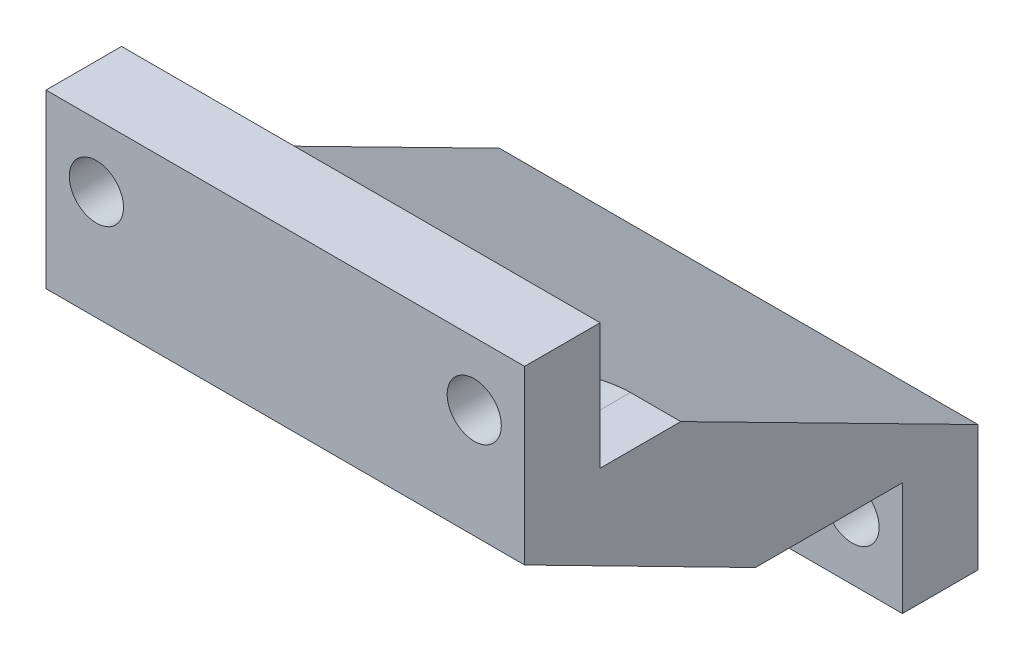
ISO-10303-21;
HEADER;
FILE_DESCRIPTION(('STEP AP214'),'2;1');
FILE_NAME('part.step','',(''),(''),'','','');
FILE_SCHEMA(('AUTOMOTIVE_DESIGN { 1 0 10303 214 1 1 1 1 }'));
ENDSEC;
DATA;
#1=APPLICATION_CONTEXT('core data for automotive mechanical design processes');
#2=APPLICATION_PROTOCOL_DEFINITION('international standard','automotive_design',2000,#1);
#3=PRODUCT_CONTEXT('',#1,'mechanical');
#4=PRODUCT('Part','Part','',(#3));
#5=PRODUCT_RELATED_PRODUCT_CATEGORY('part','',(#4));
#6=PRODUCT_DEFINITION_FORMATION('','',#4);
#7=PRODUCT_DEFINITION_CONTEXT('part definition',#1,'design');
#8=PRODUCT_DEFINITION('design','',#6,#7);
#9=PRODUCT_DEFINITION_SHAPE('','',#8);
#10=(LENGTH_UNIT() NAMED_UNIT(*) SI_UNIT(.MILLI.,.METRE.));
#11=(NAMED_UNIT(*) PLANE_ANGLE_UNIT() SI_UNIT($,.RADIAN.));
#12=(NAMED_UNIT(*) SI_UNIT($,.STERADIAN.) SOLID_ANGLE_UNIT());
#13=UNCERTAINTY_MEASURE_WITH_UNIT(LENGTH_MEASURE(1.E-05),#10,'distance_accuracy_value','');
#14=(GEOMETRIC_REPRESENTATION_CONTEXT(3) GLOBAL_UNCERTAINTY_ASSIGNED_CONTEXT((#13)) GLOBAL_UNIT_ASSIGNED_CONTEXT((#10,
#11,#12)) REPRESENTATION_CONTEXT('',''));
#15=CARTESIAN_POINT('',(0.,0.,0.));
#16=DIRECTION('',(0.,0.,1.));
#17=DIRECTION('',(1.,0.,0.));
#18=AXIS2_PLACEMENT_3D('',#15,#16,#17);
#19=CARTESIAN_POINT('',(84.988658439,-74.005114056,-33.2));
#20=DIRECTION('',(0.,0.,-1.));
#21=DIRECTION('',(0.,-1.,0.));
#22=AXIS2_PLACEMENT_3D('',#19,#20,#21);
#23=CYLINDRICAL_SURFACE('',#22,5.);
#24=DIRECTION('',(0.,0.,-1.));
#25=VECTOR('',#24,1.);
#26=CARTESIAN_POINT('',(84.988658439,-79.005114056,-33.2));
#27=LINE('',#26,#25);
#28=CARTESIAN_POINT('',(84.988658439,-79.005114056,-33.2));
#29=VERTEX_POINT('',#28);
#30=CARTESIAN_POINT('',(84.988658439,-79.005114056,-39.603895088));
#31=VERTEX_POINT('',#30);
#32=EDGE_CURVE('E11',#29,#31,#27,.T.);
#33=ORIENTED_EDGE('',*,*,#32,.F.);
#34=CARTESIAN_POINT('',(84.988658439,-74.005114056,-33.2));
#35=DIRECTION('',(0.,0.,1.));
#36=DIRECTION('',(1.,0.,0.));
#37=AXIS2_PLACEMENT_3D('',#34,#35,#36);
#38=CIRCLE('',#37,5.);
#39=CARTESIAN_POINT('',(89.674925408,-75.7483587,-33.2));
#40=VERTEX_POINT('',#39);
#41=EDGE_CURVE('E347',#29,#40,#38,.T.);
#42=ORIENTED_EDGE('',*,*,#41,.T.);
#43=CARTESIAN_POINT('',(84.988658439,-74.005114056,-29.772184708));
#44=DIRECTION('',(0.,-0.891354901098317,0.45330612205));
#45=DIRECTION('',(0.,-0.45330612205,-0.891354901098317));
#46=AXIS2_PLACEMENT_3D('',#43,#44,#45);
#47=ELLIPSE('',#46,11.030073844,5.);
#48=EDGE_CURVE('E323',#31,#40,#47,.T.);
#49=ORIENTED_EDGE('',*,*,#48,.F.);
#50=EDGE_LOOP('',(#33,#42,#49));
#51=FACE_BOUND('',#50,.T.);
#52=ADVANCED_FACE('F16',(#51),#23,.F.);
#53=CARTESIAN_POINT('',(84.988658439,-79.005114056,-33.2));
#54=DIRECTION('',(0.,1.,0.));
#55=DIRECTION('',(1.,0.,0.));
#56=AXIS2_PLACEMENT_3D('',#53,#54,#55);
#57=PLANE('',#56);
#58=DIRECTION('',(0.,0.,-1.));
#59=VECTOR('',#58,1.);
#60=CARTESIAN_POINT('',(80.988658439,-79.005114056,-33.2));
#61=LINE('',#60,#59);
#62=CARTESIAN_POINT('',(80.988658439,-79.005114056,-33.2));
#63=VERTEX_POINT('',#62);
#64=CARTESIAN_POINT('',(80.988658439,-79.005114056,-39.603895088));
#65=VERTEX_POINT('',#64);
#66=EDGE_CURVE('E457',#63,#65,#61,.T.);
#67=ORIENTED_EDGE('',*,*,#66,.F.);
#68=DIRECTION('',(1.,0.,0.));
#69=VECTOR('',#68,1.);
#70=CARTESIAN_POINT('',(80.988658439,-79.005114056,-33.2));
#71=LINE('',#70,#69);
#72=EDGE_CURVE('E444',#63,#29,#71,.T.);
#73=ORIENTED_EDGE('',*,*,#72,.T.);
#74=ORIENTED_EDGE('',*,*,#32,.T.);
#75=DIRECTION('',(1.,0.,0.));
#76=VECTOR('',#75,1.);
#77=CARTESIAN_POINT('',(80.988658439,-79.005114056,-39.603895088));
#78=LINE('',#77,#76);
#79=EDGE_CURVE('E328',#65,#31,#78,.T.);
#80=ORIENTED_EDGE('',*,*,#79,.F.);
#81=EDGE_LOOP('',(#67,#73,#74,#80));
#82=FACE_BOUND('',#81,.T.);
#83=ADVANCED_FACE('F525',(#82),#57,.T.);
#84=CARTESIAN_POINT('',(114.988658439,-79.005114056,-33.2));
#85=DIRECTION('',(0.,1.,0.));
#86=DIRECTION('',(1.,0.,0.));
#87=AXIS2_PLACEMENT_3D('',#84,#85,#86);
#88=PLANE('',#87);
#89=DIRECTION('',(0.,0.,-1.));
#90=VECTOR('',#89,1.);
#91=CARTESIAN_POINT('',(114.988658439,-79.005114056,-33.2));
#92=LINE('',#91,#90);
#93=CARTESIAN_POINT('',(114.988658439,-79.005114056,-33.2));
#94=VERTEX_POINT('',#93);
#95=CARTESIAN_POINT('',(114.988658439,-79.005114056,-39.603895088));
#96=VERTEX_POINT('',#95);
#97=EDGE_CURVE('E27',#94,#96,#92,.T.);
#98=ORIENTED_EDGE('',*,*,#97,.F.);
#99=DIRECTION('',(1.,0.,0.));
#100=VECTOR('',#99,1.);
#101=CARTESIAN_POINT('',(114.988658439,-79.005114056,-33.2));
#102=LINE('',#101,#100);
#103=CARTESIAN_POINT('',(118.988658439,-79.005114056,-33.2));
#104=VERTEX_POINT('',#103);
#105=EDGE_CURVE('E318',#94,#104,#102,.T.);
#106=ORIENTED_EDGE('',*,*,#105,.T.);
#107=DIRECTION('',(0.,0.,-1.));
#108=VECTOR('',#107,1.);
#109=CARTESIAN_POINT('',(118.988658439,-79.005114056,-33.2));
#110=LINE('',#109,#108);
#111=CARTESIAN_POINT('',(118.988658439,-79.005114056,-39.603895088));
#112=VERTEX_POINT('',#111);
#113=EDGE_CURVE('E299',#104,#112,#110,.T.);
#114=ORIENTED_EDGE('',*,*,#113,.T.);
#115=DIRECTION('',(1.,0.,0.));
#116=VECTOR('',#115,1.);
#117=CARTESIAN_POINT('',(114.988658439,-79.005114056,-39.603895088));
#118=LINE('',#117,#116);
#119=EDGE_CURVE('E304',#96,#112,#118,.T.);
#120=ORIENTED_EDGE('',*,*,#119,.F.);
#121=EDGE_LOOP('',(#98,#106,#114,#120));
#122=FACE_BOUND('',#121,.T.);
#123=ADVANCED_FACE('F531',(#122),#88,.T.);
#124=CARTESIAN_POINT('',(114.988658439,-74.005114056,-33.2));
#125=DIRECTION('',(0.,0.,-1.));
#126=DIRECTION('',(-1.,0.,0.));
#127=AXIS2_PLACEMENT_3D('',#124,#125,#126);
#128=CYLINDRICAL_SURFACE('',#127,5.);
#129=CARTESIAN_POINT('',(114.988658439,-74.005114056,-33.2));
#130=DIRECTION('',(0.,0.,1.));
#131=DIRECTION('',(1.,0.,0.));
#132=AXIS2_PLACEMENT_3D('',#129,#130,#131);
#133=CIRCLE('',#132,5.);
#134=CARTESIAN_POINT('',(110.302391469,-75.7483587,-33.2));
#135=VERTEX_POINT('',#134);
#136=EDGE_CURVE('E313',#135,#94,#133,.T.);
#137=ORIENTED_EDGE('',*,*,#136,.T.);
#138=ORIENTED_EDGE('',*,*,#97,.T.);
#139=CARTESIAN_POINT('',(114.988658439,-74.005114056,-29.772184708));
#140=DIRECTION('',(0.,-0.891354901098317,0.45330612205));
#141=DIRECTION('',(0.,-0.45330612205,-0.891354901098317));
#142=AXIS2_PLACEMENT_3D('',#139,#140,#141);
#143=ELLIPSE('',#142,11.030073844,5.);
#144=EDGE_CURVE('E416',#135,#96,#143,.T.);
#145=ORIENTED_EDGE('',*,*,#144,.F.);
#146=EDGE_LOOP('',(#137,#138,#145));
#147=FACE_BOUND('',#146,.T.);
#148=ADVANCED_FACE('F543',(#147),#128,.F.);
#149=CARTESIAN_POINT('',(110.988658439,-96.005114056,-24.2));
#150=DIRECTION('',(1.,0.,0.));
#151=DIRECTION('',(0.,1.,0.));
#152=AXIS2_PLACEMENT_3D('',#149,#150,#151);
#153=PLANE('',#152);
#154=DIRECTION('',(0.,-1.,0.));
#155=VECTOR('',#154,1.);
#156=CARTESIAN_POINT('',(110.988658439,-96.005114056,-57.2));
#157=LINE('',#156,#155);
#158=CARTESIAN_POINT('',(110.988658439,-96.005114056,-57.2));
#159=VERTEX_POINT('',#158);
#160=CARTESIAN_POINT('',(110.988658439,-97.94844739,-57.2));
#161=VERTEX_POINT('',#160);
#162=EDGE_CURVE('E393',#159,#161,#157,.T.);
#163=ORIENTED_EDGE('',*,*,#162,.F.);
#164=DIRECTION('',(0.,0.,-1.));
#165=VECTOR('',#164,1.);
#166=CARTESIAN_POINT('',(110.988658439,-96.005114056,-53.385387132));
#167=LINE('',#166,#165);
#168=CARTESIAN_POINT('',(110.988658439,-96.005114056,-53.385387132));
#169=VERTEX_POINT('',#168);
#170=EDGE_CURVE('E356',#169,#159,#167,.T.);
#171=ORIENTED_EDGE('',*,*,#170,.F.);
#172=DIRECTION('',(0.,0.453933197028941,0.891035719056809));
#173=VECTOR('',#172,1.);
#174=CARTESIAN_POINT('',(110.988658439,-97.94844739,-57.2));
#175=LINE('',#174,#173);
#176=EDGE_CURVE('E309',#161,#169,#175,.T.);
#177=ORIENTED_EDGE('',*,*,#176,.F.);
#178=EDGE_LOOP('',(#163,#171,#177));
#179=FACE_BOUND('',#178,.T.);
#180=ADVANCED_FACE('F546',(#179),#153,.T.);
#181=CARTESIAN_POINT('',(114.988658439,-96.005114056,-24.2));
#182=DIRECTION('',(0.,0.,-1.));
#183=DIRECTION('',(0.,1.,0.));
#184=AXIS2_PLACEMENT_3D('',#181,#182,#183);
#185=CYLINDRICAL_SURFACE('',#184,4.);
#186=ORIENTED_EDGE('',*,*,#170,.T.);
#187=CARTESIAN_POINT('',(114.988658439,-96.005114056,-57.2));
#188=DIRECTION('',(0.,0.,1.));
#189=DIRECTION('',(0.,-1.,0.));
#190=AXIS2_PLACEMENT_3D('',#187,#188,#189);
#191=CIRCLE('',#190,4.);
#192=CARTESIAN_POINT('',(114.988658439,-92.005114056,-57.2));
#193=VERTEX_POINT('',#192);
#194=EDGE_CURVE('E482',#193,#159,#191,.T.);
#195=ORIENTED_EDGE('',*,*,#194,.F.);
#196=DIRECTION('',(0.,0.,-1.));
#197=VECTOR('',#196,1.);
#198=CARTESIAN_POINT('',(114.988658439,-92.005114056,-45.533696838));
#199=LINE('',#198,#197);
#200=CARTESIAN_POINT('',(114.988658439,-92.005114056,-45.533696838));
#201=VERTEX_POINT('',#200);
#202=EDGE_CURVE('E359',#201,#193,#199,.T.);
#203=ORIENTED_EDGE('',*,*,#202,.F.);
#204=CARTESIAN_POINT('',(114.988658439,-96.005114056,-53.385387132));
#205=DIRECTION('',(0.,0.891035719056809,-0.453933197028941));
#206=DIRECTION('',(0.,-0.453933197028941,-0.891035719056809));
#207=AXIS2_PLACEMENT_3D('',#204,#205,#206);
#208=ELLIPSE('',#207,8.811869295,4.);
#209=EDGE_CURVE('E288',#169,#201,#208,.T.);
#210=ORIENTED_EDGE('',*,*,#209,.F.);
#211=EDGE_LOOP('',(#186,#195,#203,#210));
#212=FACE_BOUND('',#211,.T.);
#213=ADVANCED_FACE('F552',(#212),#185,.F.);
#214=CARTESIAN_POINT('',(114.988658439,-92.005114056,-24.2));
#215=DIRECTION('',(0.,-1.,0.));
#216=DIRECTION('',(0.,0.,-1.));
#217=AXIS2_PLACEMENT_3D('',#214,#215,#216);
#218=PLANE('',#217);
#219=ORIENTED_EDGE('',*,*,#202,.T.);
#220=DIRECTION('',(-1.,0.,0.));
#221=VECTOR('',#220,1.);
#222=CARTESIAN_POINT('',(118.988658439,-92.005114056,-57.2));
#223=LINE('',#222,#221);
#224=CARTESIAN_POINT('',(118.988658439,-92.005114056,-57.2));
#225=VERTEX_POINT('',#224);
#226=EDGE_CURVE('E20',#225,#193,#223,.T.);
#227=ORIENTED_EDGE('',*,*,#226,.F.);
#228=DIRECTION('',(0.,0.,-1.));
#229=VECTOR('',#228,1.);
#230=CARTESIAN_POINT('',(118.988658439,-92.005114056,-45.533696838));
#231=LINE('',#230,#229);
#232=CARTESIAN_POINT('',(118.988658439,-92.005114056,-45.533696838));
#233=VERTEX_POINT('',#232);
#234=EDGE_CURVE('E264',#233,#225,#231,.T.);
#235=ORIENTED_EDGE('',*,*,#234,.F.);
#236=DIRECTION('',(1.,0.,0.));
#237=VECTOR('',#236,1.);
#238=CARTESIAN_POINT('',(114.988658439,-92.005114056,-45.533696838));
#239=LINE('',#238,#237);
#240=EDGE_CURVE('E281',#201,#233,#239,.T.);
#241=ORIENTED_EDGE('',*,*,#240,.F.);
#242=EDGE_LOOP('',(#219,#227,#235,#241));
#243=FACE_BOUND('',#242,.T.);
#244=ADVANCED_FACE('F551',(#243),#218,.T.);
#245=CARTESIAN_POINT('',(84.988658439,-92.005114056,-24.2));
#246=DIRECTION('',(0.,-1.,0.));
#247=DIRECTION('',(0.,0.,-1.));
#248=AXIS2_PLACEMENT_3D('',#245,#246,#247);
#249=PLANE('',#248);
#250=DIRECTION('',(0.,0.,-1.));
#251=VECTOR('',#250,1.);
#252=CARTESIAN_POINT('',(80.988658439,-92.005114056,-45.533696838));
#253=LINE('',#252,#251);
#254=CARTESIAN_POINT('',(80.988658439,-92.005114056,-45.533696838));
#255=VERTEX_POINT('',#254);
#256=CARTESIAN_POINT('',(80.988658439,-92.005114056,-57.2));
#257=VERTEX_POINT('',#256);
#258=EDGE_CURVE('E296',#255,#257,#253,.T.);
#259=ORIENTED_EDGE('',*,*,#258,.T.);
#260=DIRECTION('',(-1.,0.,0.));
#261=VECTOR('',#260,1.);
#262=CARTESIAN_POINT('',(84.988658439,-92.005114056,-57.2));
#263=LINE('',#262,#261);
#264=CARTESIAN_POINT('',(84.988658439,-92.005114056,-57.2));
#265=VERTEX_POINT('',#264);
#266=EDGE_CURVE('E338',#265,#257,#263,.T.);
#267=ORIENTED_EDGE('',*,*,#266,.F.);
#268=DIRECTION('',(0.,0.,-1.));
#269=VECTOR('',#268,1.);
#270=CARTESIAN_POINT('',(84.988658439,-92.005114056,-45.533696838));
#271=LINE('',#270,#269);
#272=CARTESIAN_POINT('',(84.988658439,-92.005114056,-45.533696838));
#273=VERTEX_POINT('',#272);
#274=EDGE_CURVE('E201',#273,#265,#271,.T.);
#275=ORIENTED_EDGE('',*,*,#274,.F.);
#276=DIRECTION('',(1.,0.,0.));
#277=VECTOR('',#276,1.);
#278=CARTESIAN_POINT('',(80.988658439,-92.005114056,-45.533696838));
#279=LINE('',#278,#277);
#280=EDGE_CURVE('E275',#255,#273,#279,.T.);
#281=ORIENTED_EDGE('',*,*,#280,.F.);
#282=EDGE_LOOP('',(#259,#267,#275,#281));
#283=FACE_BOUND('',#282,.T.);
#284=ADVANCED_FACE('F548',(#283),#249,.T.);
#285=CARTESIAN_POINT('',(84.988658439,-96.005114056,-24.2));
#286=DIRECTION('',(0.,0.,-1.));
#287=DIRECTION('',(1.,0.,0.));
#288=AXIS2_PLACEMENT_3D('',#285,#286,#287);
#289=CYLINDRICAL_SURFACE('',#288,4.);
#290=ORIENTED_EDGE('',*,*,#274,.T.);
#291=CARTESIAN_POINT('',(84.988658439,-96.005114056,-57.2));
#292=DIRECTION('',(0.,0.,1.));
#293=DIRECTION('',(-1.,0.,0.));
#294=AXIS2_PLACEMENT_3D('',#291,#292,#293);
#295=CIRCLE('',#294,4.);
#296=CARTESIAN_POINT('',(88.988658439,-96.005114056,-57.2));
#297=VERTEX_POINT('',#296);
#298=EDGE_CURVE('E333',#297,#265,#295,.T.);
#299=ORIENTED_EDGE('',*,*,#298,.F.);
#300=DIRECTION('',(0.,0.,-1.));
#301=VECTOR('',#300,1.);
#302=CARTESIAN_POINT('',(88.988658439,-96.005114056,-53.385387132));
#303=LINE('',#302,#301);
#304=CARTESIAN_POINT('',(88.988658439,-96.005114056,-53.385387132));
#305=VERTEX_POINT('',#304);
#306=EDGE_CURVE('E211',#305,#297,#303,.T.);
#307=ORIENTED_EDGE('',*,*,#306,.F.);
#308=CARTESIAN_POINT('',(84.988658439,-96.005114056,-53.385387132));
#309=DIRECTION('',(0.,0.891035719056809,-0.453933197028941));
#310=DIRECTION('',(0.,-0.453933197028941,-0.891035719056809));
#311=AXIS2_PLACEMENT_3D('',#308,#309,#310);
#312=ELLIPSE('',#311,8.811869295,4.);
#313=EDGE_CURVE('E411',#273,#305,#312,.T.);
#314=ORIENTED_EDGE('',*,*,#313,.F.);
#315=EDGE_LOOP('',(#290,#299,#307,#314));
#316=FACE_BOUND('',#315,.T.);
#317=ADVANCED_FACE('F550',(#316),#289,.F.);
#318=CARTESIAN_POINT('',(88.988658439,-96.005114056,-24.2));
#319=DIRECTION('',(-1.,0.,0.));
#320=DIRECTION('',(0.,0.,1.));
#321=AXIS2_PLACEMENT_3D('',#318,#319,#320);
#322=PLANE('',#321);
#323=ORIENTED_EDGE('',*,*,#306,.T.);
#324=DIRECTION('',(0.,1.,0.));
#325=VECTOR('',#324,1.);
#326=CARTESIAN_POINT('',(88.988658439,-97.94844739,-57.2));
#327=LINE('',#326,#325);
#328=CARTESIAN_POINT('',(88.988658439,-97.94844739,-57.2));
#329=VERTEX_POINT('',#328);
#330=EDGE_CURVE('E329',#329,#297,#327,.T.);
#331=ORIENTED_EDGE('',*,*,#330,.F.);
#332=DIRECTION('',(0.,-0.453933197028941,-0.891035719056809));
#333=VECTOR('',#332,1.);
#334=CARTESIAN_POINT('',(88.988658439,-96.005114056,-53.385387132));
#335=LINE('',#334,#333);
#336=EDGE_CURVE('E310',#305,#329,#335,.T.);
#337=ORIENTED_EDGE('',*,*,#336,.F.);
#338=EDGE_LOOP('',(#323,#331,#337));
#339=FACE_BOUND('',#338,.T.);
#340=ADVANCED_FACE('F536',(#339),#322,.T.);
#341=CARTESIAN_POINT('',(114.988658439,-74.005114056,-13.2));
#342=DIRECTION('',(0.,0.,-1.));
#343=DIRECTION('',(1.,0.,0.));
#344=AXIS2_PLACEMENT_3D('',#341,#342,#343);
#345=CYLINDRICAL_SURFACE('',#344,2.15);
#346=DIRECTION('',(0.,0.,1.));
#347=VECTOR('',#346,1.);
#348=CARTESIAN_POINT('',(117.138658439,-74.005114056,-33.2));
#349=LINE('',#348,#347);
#350=CARTESIAN_POINT('',(117.138658439,-74.005114056,-33.2));
#351=VERTEX_POINT('',#350);
#352=CARTESIAN_POINT('',(117.138658439,-74.005114056,-27.2));
#353=VERTEX_POINT('',#352);
#354=EDGE_CURVE('E350',#351,#353,#349,.T.);
#355=ORIENTED_EDGE('',*,*,#354,.F.);
#356=CARTESIAN_POINT('',(114.988658439,-74.005114056,-33.2));
#357=DIRECTION('',(0.,0.,-1.));
#358=DIRECTION('',(-1.,0.,0.));
#359=AXIS2_PLACEMENT_3D('',#356,#357,#358);
#360=CIRCLE('',#359,2.15);
#361=CARTESIAN_POINT('',(112.838658439,-74.005114056,-33.2));
#362=VERTEX_POINT('',#361);
#363=EDGE_CURVE('E339',#351,#362,#360,.T.);
#364=ORIENTED_EDGE('',*,*,#363,.T.);
#365=CARTESIAN_POINT('',(114.988658439,-74.005114056,-33.2));
#366=DIRECTION('',(0.,0.,-1.));
#367=DIRECTION('',(-1.,0.,0.));
#368=AXIS2_PLACEMENT_3D('',#365,#366,#367);
#369=CIRCLE('',#368,2.15);
#370=EDGE_CURVE('E343',#362,#351,#369,.T.);
#371=ORIENTED_EDGE('',*,*,#370,.T.);
#372=ORIENTED_EDGE('',*,*,#354,.T.);
#373=CARTESIAN_POINT('',(114.988658439,-74.005114056,-27.2));
#374=DIRECTION('',(0.,0.,-1.));
#375=DIRECTION('',(-1.,0.,0.));
#376=AXIS2_PLACEMENT_3D('',#373,#374,#375);
#377=CIRCLE('',#376,2.15);
#378=CARTESIAN_POINT('',(112.838658439,-74.005114056,-27.2));
#379=VERTEX_POINT('',#378);
#380=EDGE_CURVE('E388',#379,#353,#377,.T.);
#381=ORIENTED_EDGE('',*,*,#380,.F.);
#382=CARTESIAN_POINT('',(114.988658439,-74.005114056,-27.2));
#383=DIRECTION('',(0.,0.,-1.));
#384=DIRECTION('',(-1.,0.,0.));
#385=AXIS2_PLACEMENT_3D('',#382,#383,#384);
#386=CIRCLE('',#385,2.15);
#387=EDGE_CURVE('E392',#353,#379,#386,.T.);
#388=ORIENTED_EDGE('',*,*,#387,.F.);
#389=EDGE_LOOP('',(#355,#364,#371,#372,#381,#388));
#390=FACE_BOUND('',#389,.T.);
#391=ADVANCED_FACE('F653',(#390),#345,.F.);
#392=CARTESIAN_POINT('',(84.988658439,-74.005114056,-13.2));
#393=DIRECTION('',(0.,0.,-1.));
#394=DIRECTION('',(1.,0.,0.));
#395=AXIS2_PLACEMENT_3D('',#392,#393,#394);
#396=CYLINDRICAL_SURFACE('',#395,2.15);
#397=DIRECTION('',(0.,0.,1.));
#398=VECTOR('',#397,1.);
#399=CARTESIAN_POINT('',(87.138658439,-74.005114056,-33.2));
#400=LINE('',#399,#398);
#401=CARTESIAN_POINT('',(87.138658439,-74.005114056,-33.2));
#402=VERTEX_POINT('',#401);
#403=CARTESIAN_POINT('',(87.138658439,-74.005114056,-27.2));
#404=VERTEX_POINT('',#403);
#405=EDGE_CURVE('E41',#402,#404,#400,.T.);
#406=ORIENTED_EDGE('',*,*,#405,.F.);
#407=CARTESIAN_POINT('',(84.988658439,-74.005114056,-33.2));
#408=DIRECTION('',(0.,0.,-1.));
#409=DIRECTION('',(-1.,0.,0.));
#410=AXIS2_PLACEMENT_3D('',#407,#408,#409);
#411=CIRCLE('',#410,2.15);
#412=CARTESIAN_POINT('',(82.838658439,-74.005114056,-33.2));
#413=VERTEX_POINT('',#412);
#414=EDGE_CURVE('E317',#402,#413,#411,.T.);
#415=ORIENTED_EDGE('',*,*,#414,.T.);
#416=CARTESIAN_POINT('',(84.988658439,-74.005114056,-33.2));
#417=DIRECTION('',(0.,0.,-1.));
#418=DIRECTION('',(-1.,0.,0.));
#419=AXIS2_PLACEMENT_3D('',#416,#417,#418);
#420=CIRCLE('',#419,2.15);
#421=EDGE_CURVE('E370',#413,#402,#420,.T.);
#422=ORIENTED_EDGE('',*,*,#421,.T.);
#423=ORIENTED_EDGE('',*,*,#405,.T.);
#424=CARTESIAN_POINT('',(84.988658439,-74.005114056,-27.2));
#425=DIRECTION('',(0.,0.,-1.));
#426=DIRECTION('',(-1.,0.,0.));
#427=AXIS2_PLACEMENT_3D('',#424,#425,#426);
#428=CIRCLE('',#427,2.15);
#429=CARTESIAN_POINT('',(82.838658439,-74.005114056,-27.2));
#430=VERTEX_POINT('',#429);
#431=EDGE_CURVE('E322',#430,#404,#428,.T.);
#432=ORIENTED_EDGE('',*,*,#431,.F.);
#433=CARTESIAN_POINT('',(84.988658439,-74.005114056,-27.2));
#434=DIRECTION('',(0.,0.,-1.));
#435=DIRECTION('',(-1.,0.,0.));
#436=AXIS2_PLACEMENT_3D('',#433,#434,#435);
#437=CIRCLE('',#436,2.15);
#438=EDGE_CURVE('E319',#404,#430,#437,.T.);
#439=ORIENTED_EDGE('',*,*,#438,.F.);
#440=EDGE_LOOP('',(#406,#415,#422,#423,#432,#439));
#441=FACE_BOUND('',#440,.T.);
#442=ADVANCED_FACE('F519',(#441),#396,.F.);
#443=CARTESIAN_POINT('',(80.988658439,-78.335114056,-27.2));
#444=DIRECTION('',(0.,0.,1.));
#445=DIRECTION('',(1.,0.,0.));
#446=AXIS2_PLACEMENT_3D('',#443,#444,#445);
#447=PLANE('',#446);
#448=DIRECTION('',(0.,-1.,0.));
#449=VECTOR('',#448,1.);
#450=CARTESIAN_POINT('',(118.988658439,-69.005114056,-27.2));
#451=LINE('',#450,#449);
#452=CARTESIAN_POINT('',(118.988658439,-69.005114056,-27.2));
#453=VERTEX_POINT('',#452);
#454=CARTESIAN_POINT('',(118.988658439,-82.665114056,-27.2));
#455=VERTEX_POINT('',#454);
#456=EDGE_CURVE('E252',#453,#455,#451,.T.);
#457=ORIENTED_EDGE('',*,*,#456,.F.);
#458=DIRECTION('',(1.,0.,0.));
#459=VECTOR('',#458,1.);
#460=CARTESIAN_POINT('',(80.988658439,-69.005114056,-27.2));
#461=LINE('',#460,#459);
#462=CARTESIAN_POINT('',(80.988658439,-69.005114056,-27.2));
#463=VERTEX_POINT('',#462);
#464=EDGE_CURVE('E220',#463,#453,#461,.T.);
#465=ORIENTED_EDGE('',*,*,#464,.F.);
#466=DIRECTION('',(0.,-1.,0.));
#467=VECTOR('',#466,1.);
#468=CARTESIAN_POINT('',(80.988658439,-69.005114056,-27.2));
#469=LINE('',#468,#467);
#470=CARTESIAN_POINT('',(80.988658439,-82.665114056,-27.2));
#471=VERTEX_POINT('',#470);
#472=EDGE_CURVE('E270',#463,#471,#469,.T.);
#473=ORIENTED_EDGE('',*,*,#472,.T.);
#474=DIRECTION('',(1.,0.,0.));
#475=VECTOR('',#474,1.);
#476=CARTESIAN_POINT('',(80.988658439,-82.665114056,-27.2));
#477=LINE('',#476,#475);
#478=EDGE_CURVE('E266',#471,#455,#477,.T.);
#479=ORIENTED_EDGE('',*,*,#478,.T.);
#480=EDGE_LOOP('',(#457,#465,#473,#479));
#481=FACE_BOUND('',#480,.T.);
#482=ORIENTED_EDGE('',*,*,#431,.T.);
#483=ORIENTED_EDGE('',*,*,#438,.T.);
#484=EDGE_LOOP('',(#482,#483));
#485=FACE_BOUND('',#484,.T.);
#486=ORIENTED_EDGE('',*,*,#380,.T.);
#487=ORIENTED_EDGE('',*,*,#387,.T.);
#488=EDGE_LOOP('',(#486,#487));
#489=FACE_BOUND('',#488,.T.);
#490=ADVANCED_FACE('F267',(#481,#485,#489),#447,.T.);
#491=CARTESIAN_POINT('',(80.988658439,-99.476780723,-57.2));
#492=DIRECTION('',(0.,0.,-1.));
#493=DIRECTION('',(0.,-1.,0.));
#494=AXIS2_PLACEMENT_3D('',#491,#492,#493);
#495=PLANE('',#494);
#496=CARTESIAN_POINT('',(84.988658439,-96.005114056,-57.2));
#497=DIRECTION('',(0.,0.,1.));
#498=DIRECTION('',(1.,0.,0.));
#499=AXIS2_PLACEMENT_3D('',#496,#497,#498);
#500=CIRCLE('',#499,2.15);
#501=CARTESIAN_POINT('',(87.138658439,-96.005114056,-57.2));
#502=VERTEX_POINT('',#501);
#503=EDGE_CURVE('E354',#502,#502,#500,.T.);
#504=ORIENTED_EDGE('',*,*,#503,.F.);
#505=EDGE_LOOP('',(#504));
#506=FACE_BOUND('',#505,.T.);
#507=DIRECTION('',(1.,0.,0.));
#508=VECTOR('',#507,1.);
#509=CARTESIAN_POINT('',(88.988658439,-97.94844739,-57.2));
#510=LINE('',#509,#508);
#511=EDGE_CURVE('E305',#329,#161,#510,.T.);
#512=ORIENTED_EDGE('',*,*,#511,.F.);
#513=ORIENTED_EDGE('',*,*,#330,.T.);
#514=ORIENTED_EDGE('',*,*,#298,.T.);
#515=ORIENTED_EDGE('',*,*,#266,.T.);
#516=DIRECTION('',(0.,1.,0.));
#517=VECTOR('',#516,1.);
#518=CARTESIAN_POINT('',(80.988658439,-101.005114056,-57.2));
#519=LINE('',#518,#517);
#520=CARTESIAN_POINT('',(80.988658439,-101.005114056,-57.2));
#521=VERTEX_POINT('',#520);
#522=EDGE_CURVE('E428',#521,#257,#519,.T.);
#523=ORIENTED_EDGE('',*,*,#522,.F.);
#524=DIRECTION('',(1.,0.,0.));
#525=VECTOR('',#524,1.);
#526=CARTESIAN_POINT('',(80.988658439,-101.005114056,-57.2));
#527=LINE('',#526,#525);
#528=CARTESIAN_POINT('',(118.988658439,-101.005114056,-57.2));
#529=VERTEX_POINT('',#528);
#530=EDGE_CURVE('E334',#521,#529,#527,.T.);
#531=ORIENTED_EDGE('',*,*,#530,.T.);
#532=DIRECTION('',(0.,1.,0.));
#533=VECTOR('',#532,1.);
#534=CARTESIAN_POINT('',(118.988658439,-101.005114056,-57.2));
#535=LINE('',#534,#533);
#536=EDGE_CURVE('E404',#529,#225,#535,.T.);
#537=ORIENTED_EDGE('',*,*,#536,.T.);
#538=ORIENTED_EDGE('',*,*,#226,.T.);
#539=ORIENTED_EDGE('',*,*,#194,.T.);
#540=ORIENTED_EDGE('',*,*,#162,.T.);
#541=EDGE_LOOP('',(#512,#513,#514,#515,#523,#531,#537,#538,#539,#540));
#542=FACE_BOUND('',#541,.T.);
#543=CARTESIAN_POINT('',(114.988658439,-96.005114056,-57.2));
#544=DIRECTION('',(0.,0.,1.));
#545=DIRECTION('',(1.,0.,0.));
#546=AXIS2_PLACEMENT_3D('',#543,#544,#545);
#547=CIRCLE('',#546,2.15);
#548=CARTESIAN_POINT('',(117.138658439,-96.005114056,-57.2));
#549=VERTEX_POINT('',#548);
#550=EDGE_CURVE('E363',#549,#549,#547,.T.);
#551=ORIENTED_EDGE('',*,*,#550,.F.);
#552=EDGE_LOOP('',(#551));
#553=FACE_BOUND('',#552,.T.);
#554=ADVANCED_FACE('F506',(#506,#542,#553),#495,.F.);
#555=CARTESIAN_POINT('',(80.988658439,-101.005114056,-60.2));
#556=DIRECTION('',(0.,1.,0.));
#557=DIRECTION('',(1.,0.,0.));
#558=AXIS2_PLACEMENT_3D('',#555,#556,#557);
#559=PLANE('',#558);
#560=DIRECTION('',(0.,0.,1.));
#561=VECTOR('',#560,1.);
#562=CARTESIAN_POINT('',(118.988658439,-101.005114056,-63.2));
#563=LINE('',#562,#561);
#564=CARTESIAN_POINT('',(118.988658439,-101.005114056,-63.2));
#565=VERTEX_POINT('',#564);
#566=EDGE_CURVE('E399',#565,#529,#563,.T.);
#567=ORIENTED_EDGE('',*,*,#566,.T.);
#568=ORIENTED_EDGE('',*,*,#530,.F.);
#569=DIRECTION('',(0.,0.,1.));
#570=VECTOR('',#569,1.);
#571=CARTESIAN_POINT('',(80.988658439,-101.005114056,-63.2));
#572=LINE('',#571,#570);
#573=CARTESIAN_POINT('',(80.988658439,-101.005114056,-63.2));
#574=VERTEX_POINT('',#573);
#575=EDGE_CURVE('E464',#574,#521,#572,.T.);
#576=ORIENTED_EDGE('',*,*,#575,.F.);
#577=DIRECTION('',(1.,0.,0.));
#578=VECTOR('',#577,1.);
#579=CARTESIAN_POINT('',(80.988658439,-101.005114056,-63.2));
#580=LINE('',#579,#578);
#581=EDGE_CURVE('E372',#574,#565,#580,.T.);
#582=ORIENTED_EDGE('',*,*,#581,.T.);
#583=EDGE_LOOP('',(#567,#568,#576,#582));
#584=FACE_BOUND('',#583,.T.);
#585=ADVANCED_FACE('F508',(#584),#559,.F.);
#586=CARTESIAN_POINT('',(80.988658439,-93.505114056,-63.2));
#587=DIRECTION('',(0.,0.,-1.));
#588=DIRECTION('',(0.,-1.,0.));
#589=AXIS2_PLACEMENT_3D('',#586,#587,#588);
#590=PLANE('',#589);
#591=DIRECTION('',(0.,1.,0.));
#592=VECTOR('',#591,1.);
#593=CARTESIAN_POINT('',(118.988658439,-101.005114056,-63.2));
#594=LINE('',#593,#592);
#595=CARTESIAN_POINT('',(118.988658439,-91.005114056,-63.2));
#596=VERTEX_POINT('',#595);
#597=EDGE_CURVE('E403',#565,#596,#594,.T.);
#598=ORIENTED_EDGE('',*,*,#597,.F.);
#599=ORIENTED_EDGE('',*,*,#581,.F.);
#600=DIRECTION('',(0.,1.,0.));
#601=VECTOR('',#600,1.);
#602=CARTESIAN_POINT('',(80.988658439,-101.005114056,-63.2));
#603=LINE('',#602,#601);
#604=CARTESIAN_POINT('',(80.988658439,-91.005114056,-63.2));
#605=VERTEX_POINT('',#604);
#606=EDGE_CURVE('E471',#574,#605,#603,.T.);
#607=ORIENTED_EDGE('',*,*,#606,.T.);
#608=DIRECTION('',(1.,0.,0.));
#609=VECTOR('',#608,1.);
#610=CARTESIAN_POINT('',(80.988658439,-91.005114056,-63.2));
#611=LINE('',#610,#609);
#612=EDGE_CURVE('E292',#605,#596,#611,.T.);
#613=ORIENTED_EDGE('',*,*,#612,.T.);
#614=EDGE_LOOP('',(#598,#599,#607,#613));
#615=FACE_BOUND('',#614,.T.);
#616=CARTESIAN_POINT('',(114.988658439,-96.005114056,-63.2));
#617=DIRECTION('',(0.,0.,1.));
#618=DIRECTION('',(-1.,0.,0.));
#619=AXIS2_PLACEMENT_3D('',#616,#617,#618);
#620=CIRCLE('',#619,2.15);
#621=CARTESIAN_POINT('',(112.838658439,-96.005114056,-63.2));
#622=VERTEX_POINT('',#621);
#623=CARTESIAN_POINT('',(117.138658439,-96.005114056,-63.2));
#624=VERTEX_POINT('',#623);
#625=EDGE_CURVE('E364',#622,#624,#620,.T.);
#626=ORIENTED_EDGE('',*,*,#625,.T.);
#627=CARTESIAN_POINT('',(114.988658439,-96.005114056,-63.2));
#628=DIRECTION('',(0.,0.,1.));
#629=DIRECTION('',(-1.,0.,0.));
#630=AXIS2_PLACEMENT_3D('',#627,#628,#629);
#631=CIRCLE('',#630,2.15);
#632=EDGE_CURVE('E360',#624,#622,#631,.T.);
#633=ORIENTED_EDGE('',*,*,#632,.T.);
#634=EDGE_LOOP('',(#626,#633));
#635=FACE_BOUND('',#634,.T.);
#636=CARTESIAN_POINT('',(84.988658439,-96.005114056,-63.2));
#637=DIRECTION('',(0.,0.,1.));
#638=DIRECTION('',(-1.,0.,0.));
#639=AXIS2_PLACEMENT_3D('',#636,#637,#638);
#640=CIRCLE('',#639,2.15);
#641=CARTESIAN_POINT('',(82.838658439,-96.005114056,-63.2));
#642=VERTEX_POINT('',#641);
#643=CARTESIAN_POINT('',(87.138658439,-96.005114056,-63.2));
#644=VERTEX_POINT('',#643);
#645=EDGE_CURVE('E355',#642,#644,#640,.T.);
#646=ORIENTED_EDGE('',*,*,#645,.T.);
#647=CARTESIAN_POINT('',(84.988658439,-96.005114056,-63.2));
#648=DIRECTION('',(0.,0.,1.));
#649=DIRECTION('',(-1.,0.,0.));
#650=AXIS2_PLACEMENT_3D('',#647,#648,#649);
#651=CIRCLE('',#650,2.15);
#652=EDGE_CURVE('E351',#644,#642,#651,.T.);
#653=ORIENTED_EDGE('',*,*,#652,.T.);
#654=EDGE_LOOP('',(#646,#653));
#655=FACE_BOUND('',#654,.T.);
#656=ADVANCED_FACE('F516',(#615,#635,#655),#590,.T.);
#657=CARTESIAN_POINT('',(80.988658439,-72.376736378,-33.2));
#658=DIRECTION('',(0.,0.,1.));
#659=DIRECTION('',(1.,0.,0.));
#660=AXIS2_PLACEMENT_3D('',#657,#658,#659);
#661=PLANE('',#660);
#662=ORIENTED_EDGE('',*,*,#414,.F.);
#663=ORIENTED_EDGE('',*,*,#421,.F.);
#664=EDGE_LOOP('',(#662,#663));
#665=FACE_BOUND('',#664,.T.);
#666=DIRECTION('',(1.,0.,0.));
#667=VECTOR('',#666,1.);
#668=CARTESIAN_POINT('',(89.674925408,-75.7483587,-33.2));
#669=LINE('',#668,#667);
#670=EDGE_CURVE('E327',#40,#135,#669,.T.);
#671=ORIENTED_EDGE('',*,*,#670,.F.);
#672=ORIENTED_EDGE('',*,*,#41,.F.);
#673=ORIENTED_EDGE('',*,*,#72,.F.);
#674=DIRECTION('',(0.,-1.,0.));
#675=VECTOR('',#674,1.);
#676=CARTESIAN_POINT('',(80.988658439,-69.005114056,-33.2));
#677=LINE('',#676,#675);
#678=CARTESIAN_POINT('',(80.988658439,-69.005114056,-33.2));
#679=VERTEX_POINT('',#678);
#680=EDGE_CURVE('E453',#679,#63,#677,.T.);
#681=ORIENTED_EDGE('',*,*,#680,.F.);
#682=DIRECTION('',(1.,0.,0.));
#683=VECTOR('',#682,1.);
#684=CARTESIAN_POINT('',(80.988658439,-69.005114056,-33.2));
#685=LINE('',#684,#683);
#686=CARTESIAN_POINT('',(118.988658439,-69.005114056,-33.2));
#687=VERTEX_POINT('',#686);
#688=EDGE_CURVE('E408',#679,#687,#685,.T.);
#689=ORIENTED_EDGE('',*,*,#688,.T.);
#690=DIRECTION('',(0.,-1.,0.));
#691=VECTOR('',#690,1.);
#692=CARTESIAN_POINT('',(118.988658439,-69.005114056,-33.2));
#693=LINE('',#692,#691);
#694=EDGE_CURVE('E407',#687,#104,#693,.T.);
#695=ORIENTED_EDGE('',*,*,#694,.T.);
#696=ORIENTED_EDGE('',*,*,#105,.F.);
#697=ORIENTED_EDGE('',*,*,#136,.F.);
#698=EDGE_LOOP('',(#671,#672,#673,#681,#689,#695,#696,#697));
#699=FACE_BOUND('',#698,.T.);
#700=ORIENTED_EDGE('',*,*,#363,.F.);
#701=ORIENTED_EDGE('',*,*,#370,.F.);
#702=EDGE_LOOP('',(#700,#701));
#703=FACE_BOUND('',#702,.T.);
#704=ADVANCED_FACE('F606',(#665,#699,#703),#661,.F.);
#705=CARTESIAN_POINT('',(80.988658439,-69.005114056,-30.2));
#706=DIRECTION('',(0.,-1.,0.));
#707=DIRECTION('',(0.,0.,-1.));
#708=AXIS2_PLACEMENT_3D('',#705,#706,#707);
#709=PLANE('',#708);
#710=DIRECTION('',(0.,0.,-1.));
#711=VECTOR('',#710,1.);
#712=CARTESIAN_POINT('',(118.988658439,-69.005114056,-27.2));
#713=LINE('',#712,#711);
#714=EDGE_CURVE('E262',#453,#687,#713,.T.);
#715=ORIENTED_EDGE('',*,*,#714,.T.);
#716=ORIENTED_EDGE('',*,*,#688,.F.);
#717=DIRECTION('',(0.,0.,-1.));
#718=VECTOR('',#717,1.);
#719=CARTESIAN_POINT('',(80.988658439,-69.005114056,-27.2));
#720=LINE('',#719,#718);
#721=EDGE_CURVE('E369',#463,#679,#720,.T.);
#722=ORIENTED_EDGE('',*,*,#721,.F.);
#723=ORIENTED_EDGE('',*,*,#464,.T.);
#724=EDGE_LOOP('',(#715,#716,#722,#723));
#725=FACE_BOUND('',#724,.T.);
#726=ADVANCED_FACE('F541',(#725),#709,.F.);
#727=CARTESIAN_POINT('',(84.988658439,-96.005114056,-34.2));
#728=DIRECTION('',(0.,0.,-1.));
#729=DIRECTION('',(1.,0.,0.));
#730=AXIS2_PLACEMENT_3D('',#727,#728,#729);
#731=CYLINDRICAL_SURFACE('',#730,2.15);
#732=DIRECTION('',(0.,0.,1.));
#733=VECTOR('',#732,1.);
#734=CARTESIAN_POINT('',(87.138658439,-96.005114056,-63.2));
#735=LINE('',#734,#733);
#736=EDGE_CURVE('E452',#644,#502,#735,.T.);
#737=ORIENTED_EDGE('',*,*,#736,.F.);
#738=ORIENTED_EDGE('',*,*,#645,.F.);
#739=ORIENTED_EDGE('',*,*,#652,.F.);
#740=ORIENTED_EDGE('',*,*,#736,.T.);
#741=ORIENTED_EDGE('',*,*,#503,.T.);
#742=EDGE_LOOP('',(#737,#738,#739,#740,#741));
#743=FACE_BOUND('',#742,.T.);
#744=ADVANCED_FACE('F538',(#743),#731,.F.);
#745=CARTESIAN_POINT('',(114.988658439,-96.005114056,-34.2));
#746=DIRECTION('',(0.,0.,-1.));
#747=DIRECTION('',(1.,0.,0.));
#748=AXIS2_PLACEMENT_3D('',#745,#746,#747);
#749=CYLINDRICAL_SURFACE('',#748,2.15);
#750=DIRECTION('',(0.,0.,1.));
#751=VECTOR('',#750,1.);
#752=CARTESIAN_POINT('',(117.138658439,-96.005114056,-63.2));
#753=LINE('',#752,#751);
#754=EDGE_CURVE('E448',#624,#549,#753,.T.);
#755=ORIENTED_EDGE('',*,*,#754,.F.);
#756=ORIENTED_EDGE('',*,*,#625,.F.);
#757=ORIENTED_EDGE('',*,*,#632,.F.);
#758=ORIENTED_EDGE('',*,*,#754,.T.);
#759=ORIENTED_EDGE('',*,*,#550,.T.);
#760=EDGE_LOOP('',(#755,#756,#757,#758,#759));
#761=FACE_BOUND('',#760,.T.);
#762=ADVANCED_FACE('F18',(#761),#749,.F.);
#763=CARTESIAN_POINT('',(118.988658439,190.994885944,247.8));
#764=DIRECTION('',(-1.,0.,0.));
#765=DIRECTION('',(0.,0.,1.));
#766=AXIS2_PLACEMENT_3D('',#763,#764,#765);
#767=PLANE('',#766);
#768=ORIENTED_EDGE('',*,*,#113,.F.);
#769=ORIENTED_EDGE('',*,*,#694,.F.);
#770=ORIENTED_EDGE('',*,*,#714,.F.);
#771=ORIENTED_EDGE('',*,*,#456,.T.);
#772=DIRECTION('',(0.,-0.453933197028941,-0.891035719056809));
#773=VECTOR('',#772,1.);
#774=CARTESIAN_POINT('',(118.988658439,-82.665114056,-27.2));
#775=LINE('',#774,#773);
#776=EDGE_CURVE('E258',#455,#233,#775,.T.);
#777=ORIENTED_EDGE('',*,*,#776,.T.);
#778=ORIENTED_EDGE('',*,*,#234,.T.);
#779=ORIENTED_EDGE('',*,*,#536,.F.);
#780=ORIENTED_EDGE('',*,*,#566,.F.);
#781=ORIENTED_EDGE('',*,*,#597,.T.);
#782=DIRECTION('',(0.,0.45330612205,0.891354901098317));
#783=VECTOR('',#782,1.);
#784=CARTESIAN_POINT('',(118.988658439,-91.005114056,-63.2));
#785=LINE('',#784,#783);
#786=EDGE_CURVE('E300',#596,#112,#785,.T.);
#787=ORIENTED_EDGE('',*,*,#786,.T.);
#788=EDGE_LOOP('',(#768,#769,#770,#771,#777,#778,#779,#780,#781,#787));
#789=FACE_BOUND('',#788,.T.);
#790=ADVANCED_FACE('F255',(#789),#767,.F.);
#791=CARTESIAN_POINT('',(80.988658439,-91.835114056,-45.2));
#792=DIRECTION('',(0.,-0.891035719056809,0.453933197028941));
#793=DIRECTION('',(-1.,0.,0.));
#794=AXIS2_PLACEMENT_3D('',#791,#792,#793);
#795=PLANE('',#794);
#796=ORIENTED_EDGE('',*,*,#313,.T.);
#797=ORIENTED_EDGE('',*,*,#336,.T.);
#798=ORIENTED_EDGE('',*,*,#511,.T.);
#799=ORIENTED_EDGE('',*,*,#176,.T.);
#800=ORIENTED_EDGE('',*,*,#209,.T.);
#801=ORIENTED_EDGE('',*,*,#240,.T.);
#802=ORIENTED_EDGE('',*,*,#776,.F.);
#803=ORIENTED_EDGE('',*,*,#478,.F.);
#804=DIRECTION('',(0.,-0.453933197028941,-0.891035719056809));
#805=VECTOR('',#804,1.);
#806=CARTESIAN_POINT('',(80.988658439,-82.665114056,-27.2));
#807=LINE('',#806,#805);
#808=EDGE_CURVE('E294',#471,#255,#807,.T.);
#809=ORIENTED_EDGE('',*,*,#808,.T.);
#810=ORIENTED_EDGE('',*,*,#280,.T.);
#811=EDGE_LOOP('',(#796,#797,#798,#799,#800,#801,#802,#803,#809,#810));
#812=FACE_BOUND('',#811,.T.);
#813=ADVANCED_FACE('F278',(#812),#795,.T.);
#814=CARTESIAN_POINT('',(80.988658439,190.994885944,247.8));
#815=DIRECTION('',(-1.,0.,0.));
#816=DIRECTION('',(0.,0.,1.));
#817=AXIS2_PLACEMENT_3D('',#814,#815,#816);
#818=PLANE('',#817);
#819=ORIENTED_EDGE('',*,*,#680,.T.);
#820=ORIENTED_EDGE('',*,*,#66,.T.);
#821=DIRECTION('',(0.,0.45330612205,0.891354901098317));
#822=VECTOR('',#821,1.);
#823=CARTESIAN_POINT('',(80.988658439,-91.005114056,-63.2));
#824=LINE('',#823,#822);
#825=EDGE_CURVE('E441',#605,#65,#824,.T.);
#826=ORIENTED_EDGE('',*,*,#825,.F.);
#827=ORIENTED_EDGE('',*,*,#606,.F.);
#828=ORIENTED_EDGE('',*,*,#575,.T.);
#829=ORIENTED_EDGE('',*,*,#522,.T.);
#830=ORIENTED_EDGE('',*,*,#258,.F.);
#831=ORIENTED_EDGE('',*,*,#808,.F.);
#832=ORIENTED_EDGE('',*,*,#472,.F.);
#833=ORIENTED_EDGE('',*,*,#721,.T.);
#834=EDGE_LOOP('',(#819,#820,#826,#827,#828,#829,#830,#831,#832,#833));
#835=FACE_BOUND('',#834,.T.);
#836=ADVANCED_FACE('F598',(#835),#818,.T.);
#837=CARTESIAN_POINT('',(80.988658439,-83.376736378,-48.2));
#838=DIRECTION('',(0.,0.891354901098317,-0.45330612205));
#839=DIRECTION('',(-1.,0.,0.));
#840=AXIS2_PLACEMENT_3D('',#837,#838,#839);
#841=PLANE('',#840);
#842=ORIENTED_EDGE('',*,*,#825,.T.);
#843=ORIENTED_EDGE('',*,*,#79,.T.);
#844=ORIENTED_EDGE('',*,*,#48,.T.);
#845=ORIENTED_EDGE('',*,*,#670,.T.);
#846=ORIENTED_EDGE('',*,*,#144,.T.);
#847=ORIENTED_EDGE('',*,*,#119,.T.);
#848=ORIENTED_EDGE('',*,*,#786,.F.);
#849=ORIENTED_EDGE('',*,*,#612,.F.);
#850=EDGE_LOOP('',(#842,#843,#844,#845,#846,#847,#848,#849));
#851=FACE_BOUND('',#850,.T.);
#852=ADVANCED_FACE('F597',(#851),#841,.T.);
#853=CLOSED_SHELL('',(#52,#83,#123,#148,#180,#213,#244,#284,#317,#340,#391,#442,#490,#554,#585,
#656,#704,#726,#744,#762,#790,#813,#836,#852));
#854=MANIFOLD_SOLID_BREP('B1',#853);
#855=ADVANCED_BREP_SHAPE_REPRESENTATION('',(#18,#854),#14);
#856=SHAPE_DEFINITION_REPRESENTATION(#9,#855);
ENDSEC;
END-ISO-10303-21;
